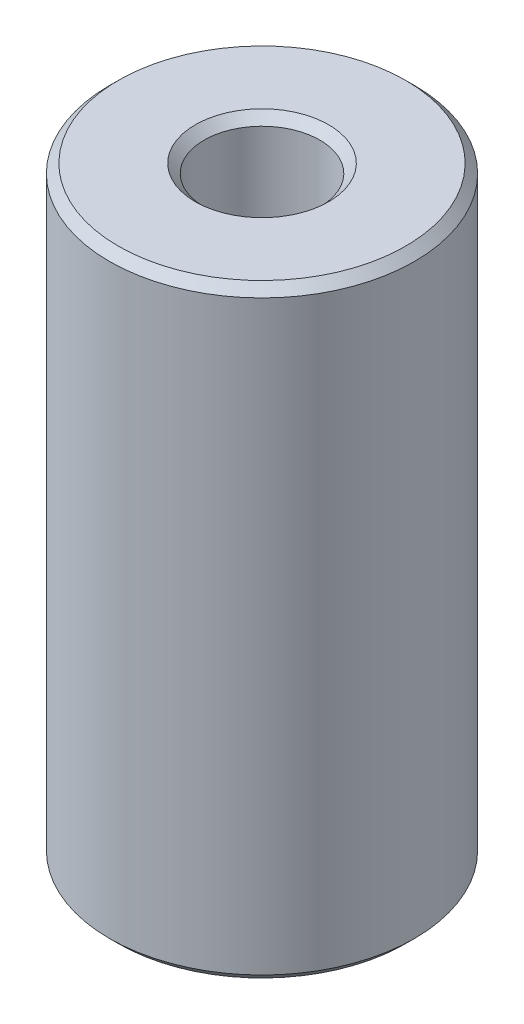
ISO-10303-21;
HEADER;
FILE_DESCRIPTION(('STEP AP214'),'2;1');
FILE_NAME('part.step','',(''),(''),'','','');
FILE_SCHEMA(('AUTOMOTIVE_DESIGN { 1 0 10303 214 1 1 1 1 }'));
ENDSEC;
DATA;
#1=APPLICATION_CONTEXT('core data for automotive mechanical design processes');
#2=APPLICATION_PROTOCOL_DEFINITION('international standard','automotive_design',2000,#1);
#3=PRODUCT_CONTEXT('',#1,'mechanical');
#4=PRODUCT('Part','Part','',(#3));
#5=PRODUCT_RELATED_PRODUCT_CATEGORY('part','',(#4));
#6=PRODUCT_DEFINITION_FORMATION('','',#4);
#7=PRODUCT_DEFINITION_CONTEXT('part definition',#1,'design');
#8=PRODUCT_DEFINITION('design','',#6,#7);
#9=PRODUCT_DEFINITION_SHAPE('','',#8);
#10=(LENGTH_UNIT() NAMED_UNIT(*) SI_UNIT(.MILLI.,.METRE.));
#11=(NAMED_UNIT(*) PLANE_ANGLE_UNIT() SI_UNIT($,.RADIAN.));
#12=(NAMED_UNIT(*) SI_UNIT($,.STERADIAN.) SOLID_ANGLE_UNIT());
#13=UNCERTAINTY_MEASURE_WITH_UNIT(LENGTH_MEASURE(1.E-05),#10,'distance_accuracy_value','');
#14=(GEOMETRIC_REPRESENTATION_CONTEXT(3) GLOBAL_UNCERTAINTY_ASSIGNED_CONTEXT((#13)) GLOBAL_UNIT_ASSIGNED_CONTEXT((#10,
#11,#12)) REPRESENTATION_CONTEXT('',''));
#15=CARTESIAN_POINT('',(0.,0.,0.));
#16=DIRECTION('',(0.,0.,1.));
#17=DIRECTION('',(1.,0.,0.));
#18=AXIS2_PLACEMENT_3D('',#15,#16,#17);
#19=CARTESIAN_POINT('',(0.,19.8084079260794,0.));
#20=DIRECTION('',(0.,-1.,0.));
#21=DIRECTION('',(0.,0.,-1.));
#22=AXIS2_PLACEMENT_3D('',#19,#20,#21);
#23=CYLINDRICAL_SURFACE('',#22,5.);
#24=CARTESIAN_POINT('',(0.,0.28986661862869,0.));
#25=DIRECTION('',(0.,1.,0.));
#26=DIRECTION('',(0.,0.,1.));
#27=AXIS2_PLACEMENT_3D('',#24,#25,#26);
#28=CIRCLE('',#27,5.);
#29=CARTESIAN_POINT('',(0.,0.28986661862869,5.));
#30=VERTEX_POINT('',#29);
#31=EDGE_CURVE('E10',#30,#30,#28,.T.);
#32=ORIENTED_EDGE('',*,*,#31,.T.);
#33=EDGE_LOOP('',(#32));
#34=FACE_BOUND('',#33,.T.);
#35=CARTESIAN_POINT('',(0.,19.5185413074507,0.));
#36=DIRECTION('',(0.,1.,0.));
#37=DIRECTION('',(0.,0.,1.));
#38=AXIS2_PLACEMENT_3D('',#35,#36,#37);
#39=CIRCLE('',#38,5.);
#40=CARTESIAN_POINT('',(0.,19.5185413074507,5.));
#41=VERTEX_POINT('',#40);
#42=EDGE_CURVE('E50',#41,#41,#39,.F.);
#43=ORIENTED_EDGE('',*,*,#42,.T.);
#44=EDGE_LOOP('',(#43));
#45=FACE_BOUND('',#44,.T.);
#46=ADVANCED_FACE('F39',(#34,#45),#23,.T.);
#47=CARTESIAN_POINT('',(0.,19.8084079260794,0.));
#48=DIRECTION('',(0.,1.,0.));
#49=DIRECTION('',(0.,0.,1.));
#50=AXIS2_PLACEMENT_3D('',#47,#48,#49);
#51=PLANE('',#50);
#52=CARTESIAN_POINT('',(0.,19.8084079260794,0.));
#53=DIRECTION('',(0.,1.,0.));
#54=DIRECTION('',(0.,0.,1.));
#55=AXIS2_PLACEMENT_3D('',#52,#53,#54);
#56=CIRCLE('',#55,2.1877874953414);
#57=CARTESIAN_POINT('',(0.,19.8084079260794,2.1877874953414));
#58=VERTEX_POINT('',#57);
#59=EDGE_CURVE('E58',#58,#58,#56,.F.);
#60=ORIENTED_EDGE('',*,*,#59,.T.);
#61=EDGE_LOOP('',(#60));
#62=FACE_BOUND('',#61,.T.);
#63=CARTESIAN_POINT('',(0.,19.8084079260794,0.));
#64=DIRECTION('',(0.,1.,0.));
#65=DIRECTION('',(0.,0.,1.));
#66=AXIS2_PLACEMENT_3D('',#63,#64,#65);
#67=CIRCLE('',#66,4.71013338137131);
#68=CARTESIAN_POINT('',(0.,19.8084079260794,4.71013338137131));
#69=VERTEX_POINT('',#68);
#70=EDGE_CURVE('E61',#69,#69,#67,.T.);
#71=ORIENTED_EDGE('',*,*,#70,.T.);
#72=EDGE_LOOP('',(#71));
#73=FACE_BOUND('',#72,.T.);
#74=ADVANCED_FACE('F88',(#62,#73),#51,.T.);
#75=CARTESIAN_POINT('',(0.,0.,0.));
#76=DIRECTION('',(0.,1.,0.));
#77=DIRECTION('',(0.,0.,1.));
#78=AXIS2_PLACEMENT_3D('',#75,#76,#77);
#79=PLANE('',#78);
#80=CARTESIAN_POINT('',(0.,0.,0.));
#81=DIRECTION('',(0.,1.,0.));
#82=DIRECTION('',(0.,0.,1.));
#83=AXIS2_PLACEMENT_3D('',#80,#81,#82);
#84=CIRCLE('',#83,2.1877874953414);
#85=CARTESIAN_POINT('',(0.,0.,2.1877874953414));
#86=VERTEX_POINT('',#85);
#87=EDGE_CURVE('E51',#86,#86,#84,.T.);
#88=ORIENTED_EDGE('',*,*,#87,.T.);
#89=EDGE_LOOP('',(#88));
#90=FACE_BOUND('',#89,.T.);
#91=CARTESIAN_POINT('',(0.,0.,0.));
#92=DIRECTION('',(0.,1.,0.));
#93=DIRECTION('',(0.,0.,1.));
#94=AXIS2_PLACEMENT_3D('',#91,#92,#93);
#95=CIRCLE('',#94,4.71013338137131);
#96=CARTESIAN_POINT('',(0.,0.,4.71013338137131));
#97=VERTEX_POINT('',#96);
#98=EDGE_CURVE('E54',#97,#97,#95,.F.);
#99=ORIENTED_EDGE('',*,*,#98,.T.);
#100=EDGE_LOOP('',(#99));
#101=FACE_BOUND('',#100,.T.);
#102=ADVANCED_FACE('F83',(#90,#101),#79,.F.);
#103=CARTESIAN_POINT('',(0.,19.8084079260794,0.));
#104=DIRECTION('',(0.,-1.,0.));
#105=DIRECTION('',(0.,0.,-1.));
#106=AXIS2_PLACEMENT_3D('',#103,#104,#105);
#107=CYLINDRICAL_SURFACE('',#106,1.89792087671271);
#108=CARTESIAN_POINT('',(0.,19.5185413074507,0.));
#109=DIRECTION('',(0.,1.,0.));
#110=DIRECTION('',(0.,0.,1.));
#111=AXIS2_PLACEMENT_3D('',#108,#109,#110);
#112=CIRCLE('',#111,1.89792087671271);
#113=CARTESIAN_POINT('',(0.,19.5185413074507,1.89792087671271));
#114=VERTEX_POINT('',#113);
#115=EDGE_CURVE('E67',#114,#114,#112,.T.);
#116=ORIENTED_EDGE('',*,*,#115,.T.);
#117=EDGE_LOOP('',(#116));
#118=FACE_BOUND('',#117,.T.);
#119=CARTESIAN_POINT('',(0.,0.289866618628693,0.));
#120=DIRECTION('',(0.,1.,0.));
#121=DIRECTION('',(0.,0.,1.));
#122=AXIS2_PLACEMENT_3D('',#119,#120,#121);
#123=CIRCLE('',#122,1.89792087671271);
#124=CARTESIAN_POINT('',(0.,0.289866618628693,1.89792087671271));
#125=VERTEX_POINT('',#124);
#126=EDGE_CURVE('E69',#125,#125,#123,.F.);
#127=ORIENTED_EDGE('',*,*,#126,.T.);
#128=EDGE_LOOP('',(#127));
#129=FACE_BOUND('',#128,.T.);
#130=ADVANCED_FACE('F71',(#118,#129),#107,.F.);
#131=CARTESIAN_POINT('',(0.,19.5185413074507,0.));
#132=DIRECTION('',(0.,1.,0.));
#133=DIRECTION('',(0.,0.,1.));
#134=AXIS2_PLACEMENT_3D('',#131,#132,#133);
#135=CONICAL_SURFACE('',#134,1.89792087671271,0.785398163397447);
#136=ORIENTED_EDGE('',*,*,#59,.F.);
#137=EDGE_LOOP('',(#136));
#138=FACE_BOUND('',#137,.T.);
#139=ORIENTED_EDGE('',*,*,#115,.F.);
#140=EDGE_LOOP('',(#139));
#141=FACE_BOUND('',#140,.T.);
#142=ADVANCED_FACE('F77',(#138,#141),#135,.F.);
#143=CARTESIAN_POINT('',(0.,0.,0.));
#144=DIRECTION('',(0.,-1.,0.));
#145=DIRECTION('',(0.,0.,-1.));
#146=AXIS2_PLACEMENT_3D('',#143,#144,#145);
#147=CONICAL_SURFACE('',#146,2.1877874953414,0.785398163397444);
#148=ORIENTED_EDGE('',*,*,#126,.F.);
#149=EDGE_LOOP('',(#148));
#150=FACE_BOUND('',#149,.T.);
#151=ORIENTED_EDGE('',*,*,#87,.F.);
#152=EDGE_LOOP('',(#151));
#153=FACE_BOUND('',#152,.T.);
#154=ADVANCED_FACE('F73',(#150,#153),#147,.F.);
#155=CARTESIAN_POINT('',(0.,0.28986661862869,0.));
#156=DIRECTION('',(0.,1.,0.));
#157=DIRECTION('',(0.,0.,1.));
#158=AXIS2_PLACEMENT_3D('',#155,#156,#157);
#159=CONICAL_SURFACE('',#158,5.,0.785398163397456);
#160=ORIENTED_EDGE('',*,*,#98,.F.);
#161=EDGE_LOOP('',(#160));
#162=FACE_BOUND('',#161,.T.);
#163=ORIENTED_EDGE('',*,*,#31,.F.);
#164=EDGE_LOOP('',(#163));
#165=FACE_BOUND('',#164,.T.);
#166=ADVANCED_FACE('F76',(#162,#165),#159,.T.);
#167=CARTESIAN_POINT('',(0.,19.8084079260794,0.));
#168=DIRECTION('',(0.,-1.,0.));
#169=DIRECTION('',(0.,0.,-1.));
#170=AXIS2_PLACEMENT_3D('',#167,#168,#169);
#171=CONICAL_SURFACE('',#170,4.71013338137131,0.785398163397441);
#172=ORIENTED_EDGE('',*,*,#42,.F.);
#173=EDGE_LOOP('',(#172));
#174=FACE_BOUND('',#173,.T.);
#175=ORIENTED_EDGE('',*,*,#70,.F.);
#176=EDGE_LOOP('',(#175));
#177=FACE_BOUND('',#176,.T.);
#178=ADVANCED_FACE('F45',(#174,#177),#171,.T.);
#179=CLOSED_SHELL('',(#46,#74,#102,#130,#142,#154,#166,#178));
#180=MANIFOLD_SOLID_BREP('B2',#179);
#181=ADVANCED_BREP_SHAPE_REPRESENTATION('',(#18,#180),#14);
#182=SHAPE_DEFINITION_REPRESENTATION(#9,#181);
ENDSEC;
END-ISO-10303-21;
